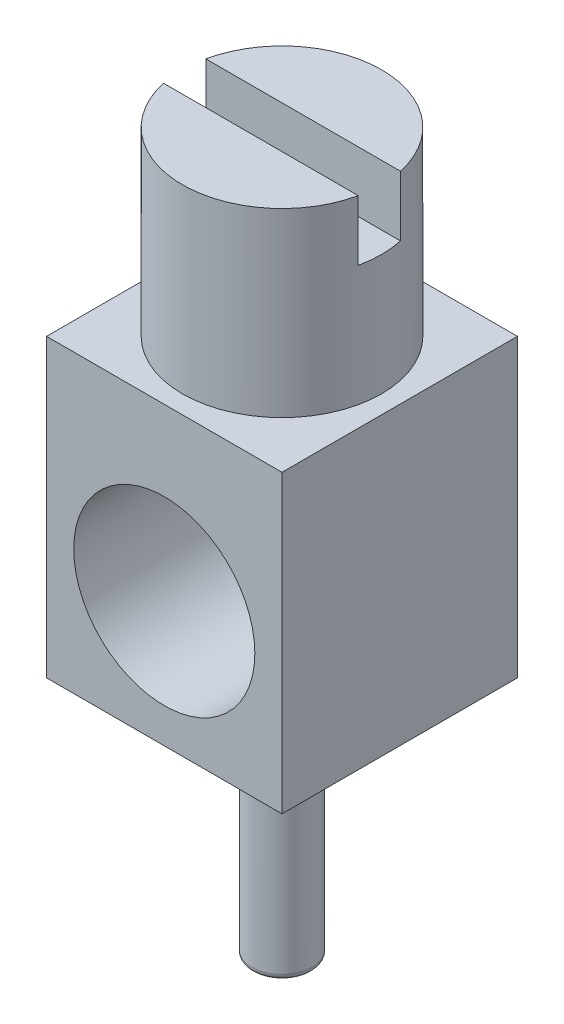
ISO-10303-21;
HEADER;
FILE_DESCRIPTION(('STEP AP214'),'2;1');
FILE_NAME('part.step','',(''),(''),'','','');
FILE_SCHEMA(('AUTOMOTIVE_DESIGN { 1 0 10303 214 1 1 1 1 }'));
ENDSEC;
DATA;
#1=APPLICATION_CONTEXT('core data for automotive mechanical design processes');
#2=APPLICATION_PROTOCOL_DEFINITION('international standard','automotive_design',2000,#1);
#3=PRODUCT_CONTEXT('',#1,'mechanical');
#4=PRODUCT('Part','Part','',(#3));
#5=PRODUCT_RELATED_PRODUCT_CATEGORY('part','',(#4));
#6=PRODUCT_DEFINITION_FORMATION('','',#4);
#7=PRODUCT_DEFINITION_CONTEXT('part definition',#1,'design');
#8=PRODUCT_DEFINITION('design','',#6,#7);
#9=PRODUCT_DEFINITION_SHAPE('','',#8);
#10=(LENGTH_UNIT() NAMED_UNIT(*) SI_UNIT(.MILLI.,.METRE.));
#11=(NAMED_UNIT(*) PLANE_ANGLE_UNIT() SI_UNIT($,.RADIAN.));
#12=(NAMED_UNIT(*) SI_UNIT($,.STERADIAN.) SOLID_ANGLE_UNIT());
#13=UNCERTAINTY_MEASURE_WITH_UNIT(LENGTH_MEASURE(1.E-05),#10,'distance_accuracy_value','');
#14=(GEOMETRIC_REPRESENTATION_CONTEXT(3) GLOBAL_UNCERTAINTY_ASSIGNED_CONTEXT((#13)) GLOBAL_UNIT_ASSIGNED_CONTEXT((#10,
#11,#12)) REPRESENTATION_CONTEXT('',''));
#15=CARTESIAN_POINT('',(0.,0.,0.));
#16=DIRECTION('',(0.,0.,1.));
#17=DIRECTION('',(1.,0.,0.));
#18=AXIS2_PLACEMENT_3D('',#15,#16,#17);
#19=CARTESIAN_POINT('',(2.3,2.,0.35));
#20=DIRECTION('',(0.,1.,0.));
#21=DIRECTION('',(0.,0.,1.));
#22=AXIS2_PLACEMENT_3D('',#19,#20,#21);
#23=PLANE('',#22);
#24=CARTESIAN_POINT('',(0.,2.,0.));
#25=DIRECTION('',(0.,-1.,0.));
#26=DIRECTION('',(0.,0.,-1.));
#27=AXIS2_PLACEMENT_3D('',#24,#25,#26);
#28=CIRCLE('',#27,1.65);
#29=CARTESIAN_POINT('',(1.61245154965986,2.,0.35));
#30=VERTEX_POINT('',#29);
#31=CARTESIAN_POINT('',(1.61245154965986,2.,-0.35));
#32=VERTEX_POINT('',#31);
#33=EDGE_CURVE('E92',#30,#32,#28,.F.);
#34=ORIENTED_EDGE('',*,*,#33,.T.);
#35=DIRECTION('',(-1.,0.,0.));
#36=VECTOR('',#35,1.);
#37=CARTESIAN_POINT('',(-2.3,2.,-0.35));
#38=LINE('',#37,#36);
#39=CARTESIAN_POINT('',(-1.61245154965986,2.,-0.35));
#40=VERTEX_POINT('',#39);
#41=EDGE_CURVE('E97',#32,#40,#38,.T.);
#42=ORIENTED_EDGE('',*,*,#41,.T.);
#43=CARTESIAN_POINT('',(0.,2.,0.));
#44=DIRECTION('',(0.,-1.,0.));
#45=DIRECTION('',(0.,0.,-1.));
#46=AXIS2_PLACEMENT_3D('',#43,#44,#45);
#47=CIRCLE('',#46,1.65);
#48=CARTESIAN_POINT('',(-1.61245154965986,2.,0.35));
#49=VERTEX_POINT('',#48);
#50=EDGE_CURVE('E21',#40,#49,#47,.F.);
#51=ORIENTED_EDGE('',*,*,#50,.T.);
#52=DIRECTION('',(1.,0.,0.));
#53=VECTOR('',#52,1.);
#54=CARTESIAN_POINT('',(-2.3,2.,0.35));
#55=LINE('',#54,#53);
#56=EDGE_CURVE('E111',#49,#30,#55,.T.);
#57=ORIENTED_EDGE('',*,*,#56,.T.);
#58=EDGE_LOOP('',(#34,#42,#51,#57));
#59=FACE_BOUND('',#58,.T.);
#60=ADVANCED_FACE('F17',(#59),#23,.T.);
#61=CARTESIAN_POINT('',(-2.3,2.,0.35));
#62=DIRECTION('',(0.,0.,1.));
#63=DIRECTION('',(1.,0.,0.));
#64=AXIS2_PLACEMENT_3D('',#61,#62,#63);
#65=PLANE('',#64);
#66=ORIENTED_EDGE('',*,*,#56,.F.);
#67=DIRECTION('',(0.,1.,0.));
#68=VECTOR('',#67,1.);
#69=CARTESIAN_POINT('',(-1.61245154966,2.,0.35));
#70=LINE('',#69,#68);
#71=CARTESIAN_POINT('',(-1.61245154965986,3.,0.35));
#72=VERTEX_POINT('',#71);
#73=EDGE_CURVE('E87',#72,#49,#70,.F.);
#74=ORIENTED_EDGE('',*,*,#73,.F.);
#75=DIRECTION('',(1.,0.,0.));
#76=VECTOR('',#75,1.);
#77=CARTESIAN_POINT('',(0.,3.,0.35));
#78=LINE('',#77,#76);
#79=CARTESIAN_POINT('',(1.61245154965986,3.,0.35));
#80=VERTEX_POINT('',#79);
#81=EDGE_CURVE('E102',#80,#72,#78,.F.);
#82=ORIENTED_EDGE('',*,*,#81,.F.);
#83=DIRECTION('',(0.,1.,0.));
#84=VECTOR('',#83,1.);
#85=CARTESIAN_POINT('',(1.61245154966,2.,0.35));
#86=LINE('',#85,#84);
#87=EDGE_CURVE('E106',#30,#80,#86,.T.);
#88=ORIENTED_EDGE('',*,*,#87,.F.);
#89=EDGE_LOOP('',(#66,#74,#82,#88));
#90=FACE_BOUND('',#89,.T.);
#91=ADVANCED_FACE('F148',(#90),#65,.F.);
#92=CARTESIAN_POINT('',(-2.3,2.,-0.35));
#93=DIRECTION('',(0.,0.,-1.));
#94=DIRECTION('',(-1.,0.,0.));
#95=AXIS2_PLACEMENT_3D('',#92,#93,#94);
#96=PLANE('',#95);
#97=ORIENTED_EDGE('',*,*,#41,.F.);
#98=DIRECTION('',(0.,1.,0.));
#99=VECTOR('',#98,1.);
#100=CARTESIAN_POINT('',(1.61245154966,2.,-0.35));
#101=LINE('',#100,#99);
#102=CARTESIAN_POINT('',(1.61245154965986,3.,-0.35));
#103=VERTEX_POINT('',#102);
#104=EDGE_CURVE('E104',#103,#32,#101,.F.);
#105=ORIENTED_EDGE('',*,*,#104,.F.);
#106=DIRECTION('',(1.,0.,0.));
#107=VECTOR('',#106,1.);
#108=CARTESIAN_POINT('',(0.,3.,-0.35));
#109=LINE('',#108,#107);
#110=CARTESIAN_POINT('',(-1.61245154965986,3.,-0.35));
#111=VERTEX_POINT('',#110);
#112=EDGE_CURVE('E100',#111,#103,#109,.T.);
#113=ORIENTED_EDGE('',*,*,#112,.F.);
#114=DIRECTION('',(0.,1.,0.));
#115=VECTOR('',#114,1.);
#116=CARTESIAN_POINT('',(-1.61245154966,2.,-0.35));
#117=LINE('',#116,#115);
#118=EDGE_CURVE('E84',#40,#111,#117,.T.);
#119=ORIENTED_EDGE('',*,*,#118,.F.);
#120=EDGE_LOOP('',(#97,#105,#113,#119));
#121=FACE_BOUND('',#120,.T.);
#122=ADVANCED_FACE('F95',(#121),#96,.F.);
#123=CARTESIAN_POINT('',(0.,-8.9,0.));
#124=DIRECTION('',(0.,-1.,0.));
#125=DIRECTION('',(0.,0.,-1.));
#126=AXIS2_PLACEMENT_3D('',#123,#124,#125);
#127=PLANE('',#126);
#128=CARTESIAN_POINT('',(0.,-8.9,0.));
#129=DIRECTION('',(0.,-1.,0.));
#130=DIRECTION('',(0.,0.,-1.));
#131=AXIS2_PLACEMENT_3D('',#128,#129,#130);
#132=CIRCLE('',#131,0.4);
#133=CARTESIAN_POINT('',(0.,-8.9,-0.4));
#134=VERTEX_POINT('',#133);
#135=EDGE_CURVE('E135',#134,#134,#132,.F.);
#136=ORIENTED_EDGE('',*,*,#135,.F.);
#137=EDGE_LOOP('',(#136));
#138=FACE_BOUND('',#137,.T.);
#139=ADVANCED_FACE('F153',(#138),#127,.T.);
#140=CARTESIAN_POINT('',(0.,3.,0.));
#141=DIRECTION('',(0.,1.,0.));
#142=DIRECTION('',(0.,0.,1.));
#143=AXIS2_PLACEMENT_3D('',#140,#141,#142);
#144=PLANE('',#143);
#145=CARTESIAN_POINT('',(0.,3.,0.));
#146=DIRECTION('',(0.,-1.,0.));
#147=DIRECTION('',(0.,0.,-1.));
#148=AXIS2_PLACEMENT_3D('',#145,#146,#147);
#149=CIRCLE('',#148,1.65);
#150=EDGE_CURVE('E133',#80,#72,#149,.T.);
#151=ORIENTED_EDGE('',*,*,#150,.F.);
#152=ORIENTED_EDGE('',*,*,#81,.T.);
#153=EDGE_LOOP('',(#151,#152));
#154=FACE_BOUND('',#153,.T.);
#155=ADVANCED_FACE('F150',(#154),#144,.T.);
#156=CARTESIAN_POINT('',(0.,3.,0.));
#157=DIRECTION('',(0.,1.,0.));
#158=DIRECTION('',(0.,0.,1.));
#159=AXIS2_PLACEMENT_3D('',#156,#157,#158);
#160=PLANE('',#159);
#161=ORIENTED_EDGE('',*,*,#112,.T.);
#162=CARTESIAN_POINT('',(0.,3.,0.));
#163=DIRECTION('',(0.,-1.,0.));
#164=DIRECTION('',(0.,0.,-1.));
#165=AXIS2_PLACEMENT_3D('',#162,#163,#164);
#166=CIRCLE('',#165,1.65);
#167=EDGE_CURVE('E131',#111,#103,#166,.T.);
#168=ORIENTED_EDGE('',*,*,#167,.F.);
#169=EDGE_LOOP('',(#161,#168));
#170=FACE_BOUND('',#169,.T.);
#171=ADVANCED_FACE('F152',(#170),#160,.T.);
#172=CARTESIAN_POINT('',(0.,-8.8,0.));
#173=DIRECTION('',(0.,-1.,0.));
#174=DIRECTION('',(0.,0.,-1.));
#175=AXIS2_PLACEMENT_3D('',#172,#173,#174);
#176=TOROIDAL_SURFACE('',#175,0.400000000000003,0.0999999999999982);
#177=CARTESIAN_POINT('',(0.,-8.8,0.));
#178=DIRECTION('',(0.,1.,0.));
#179=DIRECTION('',(0.,0.,1.));
#180=AXIS2_PLACEMENT_3D('',#177,#178,#179);
#181=CIRCLE('',#180,0.5);
#182=CARTESIAN_POINT('',(0.,-8.8,0.5));
#183=VERTEX_POINT('',#182);
#184=EDGE_CURVE('E130',#183,#183,#181,.T.);
#185=ORIENTED_EDGE('',*,*,#184,.F.);
#186=EDGE_LOOP('',(#185));
#187=FACE_BOUND('',#186,.T.);
#188=ORIENTED_EDGE('',*,*,#135,.T.);
#189=EDGE_LOOP('',(#188));
#190=FACE_BOUND('',#189,.T.);
#191=ADVANCED_FACE('F19',(#187,#190),#176,.T.);
#192=CARTESIAN_POINT('',(0.,3.,0.));
#193=DIRECTION('',(0.,-1.,0.));
#194=DIRECTION('',(0.,0.,-1.));
#195=AXIS2_PLACEMENT_3D('',#192,#193,#194);
#196=CYLINDRICAL_SURFACE('',#195,1.65);
#197=ORIENTED_EDGE('',*,*,#87,.T.);
#198=ORIENTED_EDGE('',*,*,#150,.T.);
#199=ORIENTED_EDGE('',*,*,#73,.T.);
#200=ORIENTED_EDGE('',*,*,#50,.F.);
#201=ORIENTED_EDGE('',*,*,#118,.T.);
#202=ORIENTED_EDGE('',*,*,#167,.T.);
#203=ORIENTED_EDGE('',*,*,#104,.T.);
#204=ORIENTED_EDGE('',*,*,#33,.F.);
#205=EDGE_LOOP('',(#197,#198,#199,#200,#201,#202,#203,#204));
#206=FACE_BOUND('',#205,.T.);
#207=CARTESIAN_POINT('',(0.,0.,0.));
#208=DIRECTION('',(0.,-1.,0.));
#209=DIRECTION('',(0.,0.,-1.));
#210=AXIS2_PLACEMENT_3D('',#207,#208,#209);
#211=CIRCLE('',#210,1.65);
#212=CARTESIAN_POINT('',(0.,0.,-1.65));
#213=VERTEX_POINT('',#212);
#214=EDGE_CURVE('E126',#213,#213,#211,.F.);
#215=ORIENTED_EDGE('',*,*,#214,.T.);
#216=EDGE_LOOP('',(#215));
#217=FACE_BOUND('',#216,.T.);
#218=ADVANCED_FACE('F82',(#206,#217),#196,.T.);
#219=CARTESIAN_POINT('',(0.,-8.9,0.));
#220=DIRECTION('',(0.,1.,0.));
#221=DIRECTION('',(0.,0.,1.));
#222=AXIS2_PLACEMENT_3D('',#219,#220,#221);
#223=CYLINDRICAL_SURFACE('',#222,0.5);
#224=ORIENTED_EDGE('',*,*,#184,.T.);
#225=EDGE_LOOP('',(#224));
#226=FACE_BOUND('',#225,.T.);
#227=CARTESIAN_POINT('',(0.,-4.9,0.));
#228=DIRECTION('',(0.,1.,0.));
#229=DIRECTION('',(0.,0.,1.));
#230=AXIS2_PLACEMENT_3D('',#227,#228,#229);
#231=CIRCLE('',#230,0.5);
#232=CARTESIAN_POINT('',(0.,-4.9,0.5));
#233=VERTEX_POINT('',#232);
#234=EDGE_CURVE('E118',#233,#233,#231,.T.);
#235=ORIENTED_EDGE('',*,*,#234,.F.);
#236=EDGE_LOOP('',(#235));
#237=FACE_BOUND('',#236,.T.);
#238=ADVANCED_FACE('F194',(#226,#237),#223,.T.);
#239=CARTESIAN_POINT('',(1.95,-4.9,-1.95));
#240=DIRECTION('',(-1.,0.,0.));
#241=DIRECTION('',(0.,0.,1.));
#242=AXIS2_PLACEMENT_3D('',#239,#240,#241);
#243=PLANE('',#242);
#244=DIRECTION('',(0.,0.,-1.));
#245=VECTOR('',#244,1.);
#246=CARTESIAN_POINT('',(1.95,-4.9,1.95));
#247=LINE('',#246,#245);
#248=CARTESIAN_POINT('',(1.95,-4.9,-1.95));
#249=VERTEX_POINT('',#248);
#250=CARTESIAN_POINT('',(1.95,-4.9,1.95));
#251=VERTEX_POINT('',#250);
#252=EDGE_CURVE('E121',#249,#251,#247,.F.);
#253=ORIENTED_EDGE('',*,*,#252,.F.);
#254=DIRECTION('',(0.,1.,0.));
#255=VECTOR('',#254,1.);
#256=CARTESIAN_POINT('',(1.95,-4.9,-1.95));
#257=LINE('',#256,#255);
#258=CARTESIAN_POINT('',(1.95,0.,-1.95));
#259=VERTEX_POINT('',#258);
#260=EDGE_CURVE('E117',#249,#259,#257,.T.);
#261=ORIENTED_EDGE('',*,*,#260,.T.);
#262=DIRECTION('',(0.,0.,-1.));
#263=VECTOR('',#262,1.);
#264=CARTESIAN_POINT('',(1.95,0.,1.95));
#265=LINE('',#264,#263);
#266=CARTESIAN_POINT('',(1.95,0.,1.95));
#267=VERTEX_POINT('',#266);
#268=EDGE_CURVE('E129',#259,#267,#265,.F.);
#269=ORIENTED_EDGE('',*,*,#268,.T.);
#270=DIRECTION('',(0.,1.,0.));
#271=VECTOR('',#270,1.);
#272=CARTESIAN_POINT('',(1.95,-4.9,1.95));
#273=LINE('',#272,#271);
#274=EDGE_CURVE('E125',#267,#251,#273,.F.);
#275=ORIENTED_EDGE('',*,*,#274,.T.);
#276=EDGE_LOOP('',(#253,#261,#269,#275));
#277=FACE_BOUND('',#276,.T.);
#278=ADVANCED_FACE('F190',(#277),#243,.F.);
#279=CARTESIAN_POINT('',(0.,-2.823334081178,1.95));
#280=DIRECTION('',(0.,0.,-1.));
#281=DIRECTION('',(-1.,0.,0.));
#282=AXIS2_PLACEMENT_3D('',#279,#280,#281);
#283=CYLINDRICAL_SURFACE('',#282,1.5);
#284=CARTESIAN_POINT('',(0.,-2.823334081178,1.95));
#285=DIRECTION('',(0.,0.,-1.));
#286=DIRECTION('',(-1.,0.,0.));
#287=AXIS2_PLACEMENT_3D('',#284,#285,#286);
#288=CIRCLE('',#287,1.5);
#289=CARTESIAN_POINT('',(-1.5,-2.823334081178,1.95));
#290=VERTEX_POINT('',#289);
#291=EDGE_CURVE('E122',#290,#290,#288,.F.);
#292=ORIENTED_EDGE('',*,*,#291,.T.);
#293=EDGE_LOOP('',(#292));
#294=FACE_BOUND('',#293,.T.);
#295=CARTESIAN_POINT('',(0.,-2.823334081178,-1.95));
#296=DIRECTION('',(0.,0.,-1.));
#297=DIRECTION('',(-1.,0.,0.));
#298=AXIS2_PLACEMENT_3D('',#295,#296,#297);
#299=CIRCLE('',#298,1.5);
#300=CARTESIAN_POINT('',(-1.5,-2.823334081178,-1.95));
#301=VERTEX_POINT('',#300);
#302=EDGE_CURVE('E113',#301,#301,#299,.T.);
#303=ORIENTED_EDGE('',*,*,#302,.T.);
#304=EDGE_LOOP('',(#303));
#305=FACE_BOUND('',#304,.T.);
#306=ADVANCED_FACE('F186',(#294,#305),#283,.F.);
#307=CARTESIAN_POINT('',(-1.95,0.,1.95));
#308=DIRECTION('',(0.,-1.,0.));
#309=DIRECTION('',(0.,0.,-1.));
#310=AXIS2_PLACEMENT_3D('',#307,#308,#309);
#311=PLANE('',#310);
#312=ORIENTED_EDGE('',*,*,#268,.F.);
#313=DIRECTION('',(1.,0.,0.));
#314=VECTOR('',#313,1.);
#315=CARTESIAN_POINT('',(1.95,0.,-1.95));
#316=LINE('',#315,#314);
#317=CARTESIAN_POINT('',(-1.95,0.,-1.95));
#318=VERTEX_POINT('',#317);
#319=EDGE_CURVE('E376',#259,#318,#316,.F.);
#320=ORIENTED_EDGE('',*,*,#319,.T.);
#321=DIRECTION('',(0.,0.,-1.));
#322=VECTOR('',#321,1.);
#323=CARTESIAN_POINT('',(-1.95,0.,-1.95));
#324=LINE('',#323,#322);
#325=CARTESIAN_POINT('',(-1.95,0.,1.95));
#326=VERTEX_POINT('',#325);
#327=EDGE_CURVE('E116',#318,#326,#324,.F.);
#328=ORIENTED_EDGE('',*,*,#327,.T.);
#329=DIRECTION('',(-1.,0.,0.));
#330=VECTOR('',#329,1.);
#331=CARTESIAN_POINT('',(1.95,0.,1.95));
#332=LINE('',#331,#330);
#333=EDGE_CURVE('E385',#326,#267,#332,.F.);
#334=ORIENTED_EDGE('',*,*,#333,.T.);
#335=EDGE_LOOP('',(#312,#320,#328,#334));
#336=FACE_BOUND('',#335,.T.);
#337=ORIENTED_EDGE('',*,*,#214,.F.);
#338=EDGE_LOOP('',(#337));
#339=FACE_BOUND('',#338,.T.);
#340=ADVANCED_FACE('F182',(#336,#339),#311,.F.);
#341=CARTESIAN_POINT('',(1.95,-4.9,1.95));
#342=DIRECTION('',(0.,0.,-1.));
#343=DIRECTION('',(-1.,0.,0.));
#344=AXIS2_PLACEMENT_3D('',#341,#342,#343);
#345=PLANE('',#344);
#346=ORIENTED_EDGE('',*,*,#291,.F.);
#347=EDGE_LOOP('',(#346));
#348=FACE_BOUND('',#347,.T.);
#349=DIRECTION('',(1.,0.,0.));
#350=VECTOR('',#349,1.);
#351=CARTESIAN_POINT('',(-1.95,-4.9,1.95));
#352=LINE('',#351,#350);
#353=CARTESIAN_POINT('',(-1.95,-4.9,1.95));
#354=VERTEX_POINT('',#353);
#355=EDGE_CURVE('E372',#251,#354,#352,.F.);
#356=ORIENTED_EDGE('',*,*,#355,.F.);
#357=ORIENTED_EDGE('',*,*,#274,.F.);
#358=ORIENTED_EDGE('',*,*,#333,.F.);
#359=DIRECTION('',(0.,1.,0.));
#360=VECTOR('',#359,1.);
#361=CARTESIAN_POINT('',(-1.95,-4.9,1.95));
#362=LINE('',#361,#360);
#363=EDGE_CURVE('E392',#326,#354,#362,.F.);
#364=ORIENTED_EDGE('',*,*,#363,.T.);
#365=EDGE_LOOP('',(#356,#357,#358,#364));
#366=FACE_BOUND('',#365,.T.);
#367=ADVANCED_FACE('F178',(#348,#366),#345,.F.);
#368=CARTESIAN_POINT('',(-1.95,-4.9,1.95));
#369=DIRECTION('',(0.,-1.,0.));
#370=DIRECTION('',(0.,0.,-1.));
#371=AXIS2_PLACEMENT_3D('',#368,#369,#370);
#372=PLANE('',#371);
#373=DIRECTION('',(0.,0.,-1.));
#374=VECTOR('',#373,1.);
#375=CARTESIAN_POINT('',(-1.95,-4.9,-1.95));
#376=LINE('',#375,#374);
#377=CARTESIAN_POINT('',(-1.95,-4.9,-1.95));
#378=VERTEX_POINT('',#377);
#379=EDGE_CURVE('E27',#354,#378,#376,.T.);
#380=ORIENTED_EDGE('',*,*,#379,.T.);
#381=DIRECTION('',(1.,0.,0.));
#382=VECTOR('',#381,1.);
#383=CARTESIAN_POINT('',(1.95,-4.9,-1.95));
#384=LINE('',#383,#382);
#385=EDGE_CURVE('E35',#378,#249,#384,.T.);
#386=ORIENTED_EDGE('',*,*,#385,.T.);
#387=ORIENTED_EDGE('',*,*,#252,.T.);
#388=ORIENTED_EDGE('',*,*,#355,.T.);
#389=EDGE_LOOP('',(#380,#386,#387,#388));
#390=FACE_BOUND('',#389,.T.);
#391=ORIENTED_EDGE('',*,*,#234,.T.);
#392=EDGE_LOOP('',(#391));
#393=FACE_BOUND('',#392,.T.);
#394=ADVANCED_FACE('F171',(#390,#393),#372,.T.);
#395=CARTESIAN_POINT('',(1.95,-4.9,-1.95));
#396=DIRECTION('',(0.,0.,1.));
#397=DIRECTION('',(1.,0.,0.));
#398=AXIS2_PLACEMENT_3D('',#395,#396,#397);
#399=PLANE('',#398);
#400=ORIENTED_EDGE('',*,*,#302,.F.);
#401=EDGE_LOOP('',(#400));
#402=FACE_BOUND('',#401,.T.);
#403=ORIENTED_EDGE('',*,*,#385,.F.);
#404=DIRECTION('',(0.,1.,0.));
#405=VECTOR('',#404,1.);
#406=CARTESIAN_POINT('',(-1.95,-4.9,-1.95));
#407=LINE('',#406,#405);
#408=EDGE_CURVE('E11',#378,#318,#407,.T.);
#409=ORIENTED_EDGE('',*,*,#408,.T.);
#410=ORIENTED_EDGE('',*,*,#319,.F.);
#411=ORIENTED_EDGE('',*,*,#260,.F.);
#412=EDGE_LOOP('',(#403,#409,#410,#411));
#413=FACE_BOUND('',#412,.T.);
#414=ADVANCED_FACE('F165',(#402,#413),#399,.F.);
#415=CARTESIAN_POINT('',(-1.95,-4.9,-1.95));
#416=DIRECTION('',(1.,0.,0.));
#417=DIRECTION('',(0.,0.,-1.));
#418=AXIS2_PLACEMENT_3D('',#415,#416,#417);
#419=PLANE('',#418);
#420=ORIENTED_EDGE('',*,*,#379,.F.);
#421=ORIENTED_EDGE('',*,*,#363,.F.);
#422=ORIENTED_EDGE('',*,*,#327,.F.);
#423=ORIENTED_EDGE('',*,*,#408,.F.);
#424=EDGE_LOOP('',(#420,#421,#422,#423));
#425=FACE_BOUND('',#424,.T.);
#426=ADVANCED_FACE('F163',(#425),#419,.F.);
#427=CLOSED_SHELL('',(#60,#91,#122,#139,#155,#171,#191,#218,#238,#278,#306,#340,#367,#394,#414,#426));
#428=MANIFOLD_SOLID_BREP('B1',#427);
#429=ADVANCED_BREP_SHAPE_REPRESENTATION('',(#18,#428),#14);
#430=SHAPE_DEFINITION_REPRESENTATION(#9,#429);
ENDSEC;
END-ISO-10303-21;
